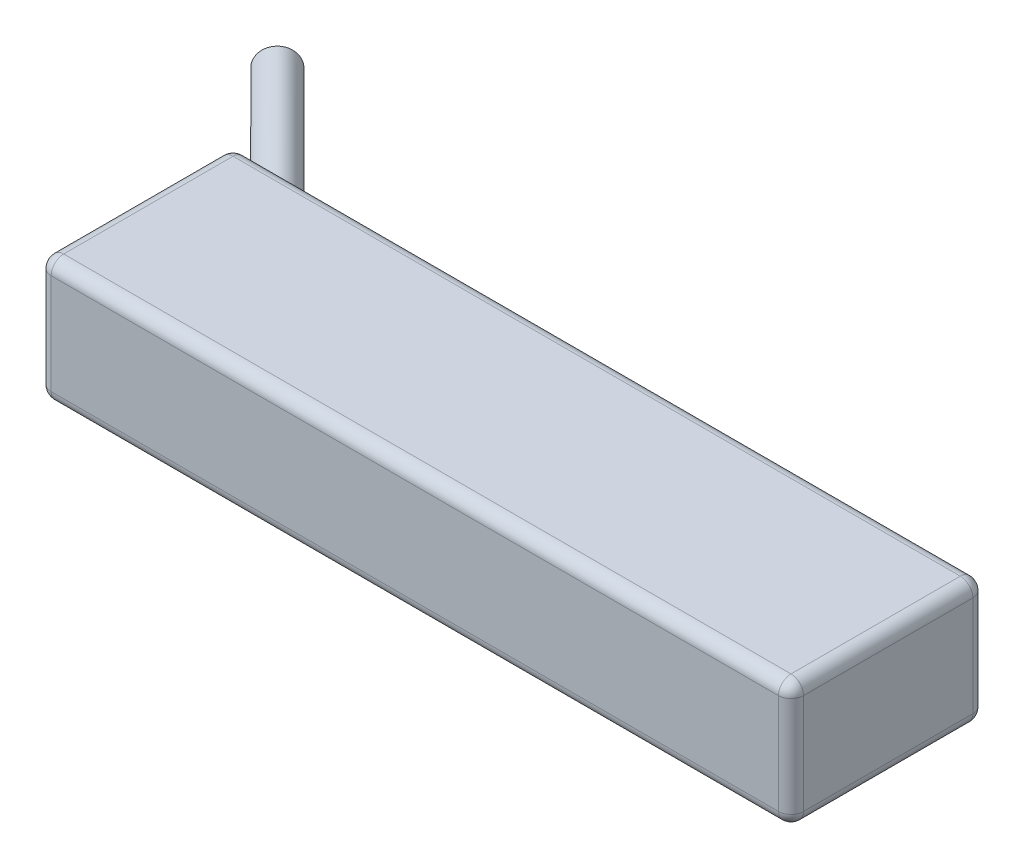
ISO-10303-21;
HEADER;
FILE_DESCRIPTION(('STEP AP214'),'2;1');
FILE_NAME('part.step','',(''),(''),'','','');
FILE_SCHEMA(('AUTOMOTIVE_DESIGN { 1 0 10303 214 1 1 1 1 }'));
ENDSEC;
DATA;
#1=APPLICATION_CONTEXT('core data for automotive mechanical design processes');
#2=APPLICATION_PROTOCOL_DEFINITION('international standard','automotive_design',2000,#1);
#3=PRODUCT_CONTEXT('',#1,'mechanical');
#4=PRODUCT('Part','Part','',(#3));
#5=PRODUCT_RELATED_PRODUCT_CATEGORY('part','',(#4));
#6=PRODUCT_DEFINITION_FORMATION('','',#4);
#7=PRODUCT_DEFINITION_CONTEXT('part definition',#1,'design');
#8=PRODUCT_DEFINITION('design','',#6,#7);
#9=PRODUCT_DEFINITION_SHAPE('','',#8);
#10=(LENGTH_UNIT() NAMED_UNIT(*) SI_UNIT(.MILLI.,.METRE.));
#11=(NAMED_UNIT(*) PLANE_ANGLE_UNIT() SI_UNIT($,.RADIAN.));
#12=(NAMED_UNIT(*) SI_UNIT($,.STERADIAN.) SOLID_ANGLE_UNIT());
#13=UNCERTAINTY_MEASURE_WITH_UNIT(LENGTH_MEASURE(1.E-05),#10,'distance_accuracy_value','');
#14=(GEOMETRIC_REPRESENTATION_CONTEXT(3) GLOBAL_UNCERTAINTY_ASSIGNED_CONTEXT((#13)) GLOBAL_UNIT_ASSIGNED_CONTEXT((#10,
#11,#12)) REPRESENTATION_CONTEXT('',''));
#15=CARTESIAN_POINT('',(0.,0.,0.));
#16=DIRECTION('',(0.,0.,1.));
#17=DIRECTION('',(1.,0.,0.));
#18=AXIS2_PLACEMENT_3D('',#15,#16,#17);
#19=CARTESIAN_POINT('',(60.,10.,-15.5));
#20=DIRECTION('',(-1.,0.,0.));
#21=DIRECTION('',(0.,0.,1.));
#22=AXIS2_PLACEMENT_3D('',#19,#20,#21);
#23=PLANE('',#22);
#24=DIRECTION('',(0.,-1.,0.));
#25=VECTOR('',#24,1.);
#26=CARTESIAN_POINT('',(60.,10.,13.5));
#27=LINE('',#26,#25);
#28=CARTESIAN_POINT('',(60.,8.,13.5));
#29=VERTEX_POINT('',#28);
#30=CARTESIAN_POINT('',(60.,-8.,13.5));
#31=VERTEX_POINT('',#30);
#32=EDGE_CURVE('E165',#29,#31,#27,.T.);
#33=ORIENTED_EDGE('',*,*,#32,.T.);
#34=DIRECTION('',(0.,0.,-1.));
#35=VECTOR('',#34,1.);
#36=CARTESIAN_POINT('',(60.,-8.,-15.5));
#37=LINE('',#36,#35);
#38=CARTESIAN_POINT('',(60.,-8.,-13.5));
#39=VERTEX_POINT('',#38);
#40=EDGE_CURVE('E170',#31,#39,#37,.T.);
#41=ORIENTED_EDGE('',*,*,#40,.T.);
#42=DIRECTION('',(0.,-1.,0.));
#43=VECTOR('',#42,1.);
#44=CARTESIAN_POINT('',(60.,10.,-13.5));
#45=LINE('',#44,#43);
#46=CARTESIAN_POINT('',(60.,8.,-13.5));
#47=VERTEX_POINT('',#46);
#48=EDGE_CURVE('E167',#39,#47,#45,.F.);
#49=ORIENTED_EDGE('',*,*,#48,.T.);
#50=DIRECTION('',(0.,0.,-1.));
#51=VECTOR('',#50,1.);
#52=CARTESIAN_POINT('',(60.,8.,15.5));
#53=LINE('',#52,#51);
#54=EDGE_CURVE('E163',#47,#29,#53,.F.);
#55=ORIENTED_EDGE('',*,*,#54,.T.);
#56=EDGE_LOOP('',(#33,#41,#49,#55));
#57=FACE_BOUND('',#56,.T.);
#58=ADVANCED_FACE('F36',(#57),#23,.F.);
#59=CARTESIAN_POINT('',(-60.,10.,-15.5));
#60=DIRECTION('',(0.,0.,1.));
#61=DIRECTION('',(1.,0.,0.));
#62=AXIS2_PLACEMENT_3D('',#59,#60,#61);
#63=PLANE('',#62);
#64=DIRECTION('',(0.,-1.,0.));
#65=VECTOR('',#64,1.);
#66=CARTESIAN_POINT('',(58.,10.,-15.5));
#67=LINE('',#66,#65);
#68=CARTESIAN_POINT('',(58.,8.,-15.5));
#69=VERTEX_POINT('',#68);
#70=CARTESIAN_POINT('',(58.,-8.,-15.5));
#71=VERTEX_POINT('',#70);
#72=EDGE_CURVE('E158',#69,#71,#67,.T.);
#73=ORIENTED_EDGE('',*,*,#72,.T.);
#74=DIRECTION('',(-1.,0.,0.));
#75=VECTOR('',#74,1.);
#76=CARTESIAN_POINT('',(-60.,-8.,-15.5));
#77=LINE('',#76,#75);
#78=CARTESIAN_POINT('',(-58.,-8.,-15.5));
#79=VERTEX_POINT('',#78);
#80=EDGE_CURVE('E161',#71,#79,#77,.T.);
#81=ORIENTED_EDGE('',*,*,#80,.T.);
#82=DIRECTION('',(0.,-1.,0.));
#83=VECTOR('',#82,1.);
#84=CARTESIAN_POINT('',(-58.,10.,-15.5));
#85=LINE('',#84,#83);
#86=CARTESIAN_POINT('',(-58.,8.,-15.5));
#87=VERTEX_POINT('',#86);
#88=EDGE_CURVE('E153',#79,#87,#85,.F.);
#89=ORIENTED_EDGE('',*,*,#88,.T.);
#90=DIRECTION('',(-1.,0.,0.));
#91=VECTOR('',#90,1.);
#92=CARTESIAN_POINT('',(60.,8.,-15.5));
#93=LINE('',#92,#91);
#94=EDGE_CURVE('E151',#87,#69,#93,.F.);
#95=ORIENTED_EDGE('',*,*,#94,.T.);
#96=EDGE_LOOP('',(#73,#81,#89,#95));
#97=FACE_BOUND('',#96,.T.);
#98=DIRECTION('',(0.,1.,0.));
#99=VECTOR('',#98,1.);
#100=CARTESIAN_POINT('',(-49.9999999999998,10.,-15.5));
#101=LINE('',#100,#99);
#102=CARTESIAN_POINT('',(-49.9999999999998,-6.17040966608935,-15.5));
#103=VERTEX_POINT('',#102);
#104=CARTESIAN_POINT('',(-49.9999999999998,-1.82959033391066,-15.5));
#105=VERTEX_POINT('',#104);
#106=EDGE_CURVE('E135',#103,#105,#101,.T.);
#107=ORIENTED_EDGE('',*,*,#106,.T.);
#108=CARTESIAN_POINT('',(-52.9289321881345,-4.,-15.5));
#109=DIRECTION('',(0.,0.,1.));
#110=DIRECTION('',(1.,0.,0.));
#111=AXIS2_PLACEMENT_3D('',#108,#109,#110);
#112=ELLIPSE('',#111,4.24264068711926,3.);
#113=EDGE_CURVE('E142',#105,#103,#112,.T.);
#114=ORIENTED_EDGE('',*,*,#113,.T.);
#115=EDGE_LOOP('',(#107,#114));
#116=FACE_BOUND('',#115,.T.);
#117=DIRECTION('',(0.,1.,0.));
#118=VECTOR('',#117,1.);
#119=CARTESIAN_POINT('',(-49.9999999999998,10.,-15.5));
#120=LINE('',#119,#118);
#121=CARTESIAN_POINT('',(-49.9999999999998,1.82959033391064,-15.5));
#122=VERTEX_POINT('',#121);
#123=CARTESIAN_POINT('',(-49.9999999999998,6.17040966608935,-15.5));
#124=VERTEX_POINT('',#123);
#125=EDGE_CURVE('E627',#122,#124,#120,.T.);
#126=ORIENTED_EDGE('',*,*,#125,.T.);
#127=CARTESIAN_POINT('',(-52.9289321881345,4.,-15.5));
#128=DIRECTION('',(0.,0.,1.));
#129=DIRECTION('',(1.,0.,0.));
#130=AXIS2_PLACEMENT_3D('',#127,#128,#129);
#131=ELLIPSE('',#130,4.24264068711927,3.);
#132=EDGE_CURVE('E143',#124,#122,#131,.T.);
#133=ORIENTED_EDGE('',*,*,#132,.T.);
#134=EDGE_LOOP('',(#126,#133));
#135=FACE_BOUND('',#134,.T.);
#136=ADVANCED_FACE('F149',(#97,#116,#135),#63,.F.);
#137=CARTESIAN_POINT('',(-60.,10.,-15.5));
#138=DIRECTION('',(1.,0.,0.));
#139=DIRECTION('',(0.,0.,-1.));
#140=AXIS2_PLACEMENT_3D('',#137,#138,#139);
#141=PLANE('',#140);
#142=DIRECTION('',(0.,-1.,0.));
#143=VECTOR('',#142,1.);
#144=CARTESIAN_POINT('',(-60.,10.,-13.5));
#145=LINE('',#144,#143);
#146=CARTESIAN_POINT('',(-60.,8.,-13.5));
#147=VERTEX_POINT('',#146);
#148=CARTESIAN_POINT('',(-60.,-8.,-13.5));
#149=VERTEX_POINT('',#148);
#150=EDGE_CURVE('E176',#147,#149,#145,.T.);
#151=ORIENTED_EDGE('',*,*,#150,.T.);
#152=DIRECTION('',(0.,0.,1.));
#153=VECTOR('',#152,1.);
#154=CARTESIAN_POINT('',(-60.,-8.,-15.5));
#155=LINE('',#154,#153);
#156=CARTESIAN_POINT('',(-60.,-8.,13.5));
#157=VERTEX_POINT('',#156);
#158=EDGE_CURVE('E179',#149,#157,#155,.T.);
#159=ORIENTED_EDGE('',*,*,#158,.T.);
#160=DIRECTION('',(0.,-1.,0.));
#161=VECTOR('',#160,1.);
#162=CARTESIAN_POINT('',(-60.,10.,13.5));
#163=LINE('',#162,#161);
#164=CARTESIAN_POINT('',(-60.,8.,13.5));
#165=VERTEX_POINT('',#164);
#166=EDGE_CURVE('E174',#157,#165,#163,.F.);
#167=ORIENTED_EDGE('',*,*,#166,.T.);
#168=DIRECTION('',(0.,0.,1.));
#169=VECTOR('',#168,1.);
#170=CARTESIAN_POINT('',(-60.,8.,-15.5));
#171=LINE('',#170,#169);
#172=EDGE_CURVE('E172',#165,#147,#171,.F.);
#173=ORIENTED_EDGE('',*,*,#172,.T.);
#174=EDGE_LOOP('',(#151,#159,#167,#173));
#175=FACE_BOUND('',#174,.T.);
#176=ADVANCED_FACE('F318',(#175),#141,.F.);
#177=CARTESIAN_POINT('',(-60.,10.,15.5));
#178=DIRECTION('',(0.,0.,-1.));
#179=DIRECTION('',(-1.,0.,0.));
#180=AXIS2_PLACEMENT_3D('',#177,#178,#179);
#181=PLANE('',#180);
#182=DIRECTION('',(0.,-1.,0.));
#183=VECTOR('',#182,1.);
#184=CARTESIAN_POINT('',(-58.,10.,15.5));
#185=LINE('',#184,#183);
#186=CARTESIAN_POINT('',(-58.,8.,15.5));
#187=VERTEX_POINT('',#186);
#188=CARTESIAN_POINT('',(-58.,-8.,15.5));
#189=VERTEX_POINT('',#188);
#190=EDGE_CURVE('E185',#187,#189,#185,.T.);
#191=ORIENTED_EDGE('',*,*,#190,.T.);
#192=DIRECTION('',(1.,0.,0.));
#193=VECTOR('',#192,1.);
#194=CARTESIAN_POINT('',(-60.,-8.,15.5));
#195=LINE('',#194,#193);
#196=CARTESIAN_POINT('',(58.,-8.,15.5));
#197=VERTEX_POINT('',#196);
#198=EDGE_CURVE('E188',#189,#197,#195,.T.);
#199=ORIENTED_EDGE('',*,*,#198,.T.);
#200=DIRECTION('',(0.,-1.,0.));
#201=VECTOR('',#200,1.);
#202=CARTESIAN_POINT('',(58.,10.,15.5));
#203=LINE('',#202,#201);
#204=CARTESIAN_POINT('',(58.,8.,15.5));
#205=VERTEX_POINT('',#204);
#206=EDGE_CURVE('E183',#197,#205,#203,.F.);
#207=ORIENTED_EDGE('',*,*,#206,.T.);
#208=DIRECTION('',(1.,0.,0.));
#209=VECTOR('',#208,1.);
#210=CARTESIAN_POINT('',(-60.,8.,15.5));
#211=LINE('',#210,#209);
#212=EDGE_CURVE('E181',#205,#187,#211,.F.);
#213=ORIENTED_EDGE('',*,*,#212,.T.);
#214=EDGE_LOOP('',(#191,#199,#207,#213));
#215=FACE_BOUND('',#214,.T.);
#216=ADVANCED_FACE('F321',(#215),#181,.F.);
#217=CARTESIAN_POINT('',(0.,10.,0.));
#218=DIRECTION('',(0.,1.,0.));
#219=DIRECTION('',(0.,0.,1.));
#220=AXIS2_PLACEMENT_3D('',#217,#218,#219);
#221=PLANE('',#220);
#222=DIRECTION('',(0.,0.,1.));
#223=VECTOR('',#222,1.);
#224=CARTESIAN_POINT('',(-58.,10.,15.5));
#225=LINE('',#224,#223);
#226=CARTESIAN_POINT('',(-58.,10.,-13.5));
#227=VERTEX_POINT('',#226);
#228=CARTESIAN_POINT('',(-58.,10.,13.5));
#229=VERTEX_POINT('',#228);
#230=EDGE_CURVE('E45',#227,#229,#225,.T.);
#231=ORIENTED_EDGE('',*,*,#230,.T.);
#232=DIRECTION('',(1.,0.,0.));
#233=VECTOR('',#232,1.);
#234=CARTESIAN_POINT('',(60.,10.,13.5));
#235=LINE('',#234,#233);
#236=CARTESIAN_POINT('',(58.,10.,13.5));
#237=VERTEX_POINT('',#236);
#238=EDGE_CURVE('E11',#229,#237,#235,.T.);
#239=ORIENTED_EDGE('',*,*,#238,.T.);
#240=DIRECTION('',(0.,0.,-1.));
#241=VECTOR('',#240,1.);
#242=CARTESIAN_POINT('',(58.,10.,-15.5));
#243=LINE('',#242,#241);
#244=CARTESIAN_POINT('',(58.,10.,-13.5));
#245=VERTEX_POINT('',#244);
#246=EDGE_CURVE('E199',#237,#245,#243,.T.);
#247=ORIENTED_EDGE('',*,*,#246,.T.);
#248=DIRECTION('',(-1.,0.,0.));
#249=VECTOR('',#248,1.);
#250=CARTESIAN_POINT('',(-60.,10.,-13.5));
#251=LINE('',#250,#249);
#252=EDGE_CURVE('E56',#245,#227,#251,.T.);
#253=ORIENTED_EDGE('',*,*,#252,.T.);
#254=EDGE_LOOP('',(#231,#239,#247,#253));
#255=FACE_BOUND('',#254,.T.);
#256=ADVANCED_FACE('F285',(#255),#221,.T.);
#257=CARTESIAN_POINT('',(0.,-10.,0.));
#258=DIRECTION('',(0.,1.,0.));
#259=DIRECTION('',(0.,0.,1.));
#260=AXIS2_PLACEMENT_3D('',#257,#258,#259);
#261=PLANE('',#260);
#262=DIRECTION('',(0.,0.,1.));
#263=VECTOR('',#262,1.);
#264=CARTESIAN_POINT('',(-58.,-10.,0.));
#265=LINE('',#264,#263);
#266=CARTESIAN_POINT('',(-58.,-10.,13.5));
#267=VERTEX_POINT('',#266);
#268=CARTESIAN_POINT('',(-58.,-10.,-13.5));
#269=VERTEX_POINT('',#268);
#270=EDGE_CURVE('E194',#267,#269,#265,.F.);
#271=ORIENTED_EDGE('',*,*,#270,.T.);
#272=DIRECTION('',(-1.,0.,0.));
#273=VECTOR('',#272,1.);
#274=CARTESIAN_POINT('',(0.,-10.,-13.5));
#275=LINE('',#274,#273);
#276=CARTESIAN_POINT('',(58.,-10.,-13.5));
#277=VERTEX_POINT('',#276);
#278=EDGE_CURVE('E196',#269,#277,#275,.F.);
#279=ORIENTED_EDGE('',*,*,#278,.T.);
#280=DIRECTION('',(0.,0.,-1.));
#281=VECTOR('',#280,1.);
#282=CARTESIAN_POINT('',(58.,-10.,0.));
#283=LINE('',#282,#281);
#284=CARTESIAN_POINT('',(58.,-10.,13.5));
#285=VERTEX_POINT('',#284);
#286=EDGE_CURVE('E190',#277,#285,#283,.F.);
#287=ORIENTED_EDGE('',*,*,#286,.T.);
#288=DIRECTION('',(1.,0.,0.));
#289=VECTOR('',#288,1.);
#290=CARTESIAN_POINT('',(0.,-10.,13.5));
#291=LINE('',#290,#289);
#292=EDGE_CURVE('E192',#285,#267,#291,.F.);
#293=ORIENTED_EDGE('',*,*,#292,.T.);
#294=EDGE_LOOP('',(#271,#279,#287,#293));
#295=FACE_BOUND('',#294,.T.);
#296=ADVANCED_FACE('F565',(#295),#261,.F.);
#297=CARTESIAN_POINT('',(-72.6776695296635,4.,-35.2487373415292));
#298=DIRECTION('',(0.707106781186544,0.,0.707106781186551));
#299=DIRECTION('',(0.707106781186551,0.,-0.707106781186544));
#300=AXIS2_PLACEMENT_3D('',#297,#298,#299);
#301=CYLINDRICAL_SURFACE('',#300,3.);
#302=CARTESIAN_POINT('',(-72.6776695296635,4.,-35.2487373415292));
#303=DIRECTION('',(0.707106781186544,0.,0.707106781186551));
#304=DIRECTION('',(0.707106781186551,0.,-0.707106781186544));
#305=AXIS2_PLACEMENT_3D('',#302,#303,#304);
#306=CIRCLE('',#305,3.);
#307=CARTESIAN_POINT('',(-70.5563491861039,4.,-37.3700576850888));
#308=VERTEX_POINT('',#307);
#309=EDGE_CURVE('E621',#308,#308,#306,.T.);
#310=ORIENTED_EDGE('',*,*,#309,.T.);
#311=EDGE_LOOP('',(#310));
#312=FACE_BOUND('',#311,.T.);
#313=ORIENTED_EDGE('',*,*,#132,.F.);
#314=CARTESIAN_POINT('',(-51.4644660940672,4.,-14.0355339059326));
#315=DIRECTION('',(0.707106781186544,0.,0.707106781186551));
#316=DIRECTION('',(0.707106781186551,0.,-0.707106781186544));
#317=AXIS2_PLACEMENT_3D('',#314,#315,#316);
#318=CIRCLE('',#317,3.);
#319=EDGE_CURVE('E626',#122,#124,#318,.T.);
#320=ORIENTED_EDGE('',*,*,#319,.F.);
#321=EDGE_LOOP('',(#313,#320));
#322=FACE_BOUND('',#321,.T.);
#323=ADVANCED_FACE('F556',(#312,#322),#301,.T.);
#324=CARTESIAN_POINT('',(-51.4644660940672,4.,-14.0355339059326));
#325=DIRECTION('',(0.707106781186544,0.,0.707106781186551));
#326=DIRECTION('',(0.707106781186551,0.,-0.707106781186544));
#327=AXIS2_PLACEMENT_3D('',#324,#325,#326);
#328=PLANE('',#327);
#329=ORIENTED_EDGE('',*,*,#125,.F.);
#330=ORIENTED_EDGE('',*,*,#319,.T.);
#331=EDGE_LOOP('',(#329,#330));
#332=FACE_BOUND('',#331,.T.);
#333=ADVANCED_FACE('F547',(#332),#328,.T.);
#334=CARTESIAN_POINT('',(-72.6776695296635,4.,-35.2487373415292));
#335=DIRECTION('',(0.707106781186544,0.,0.707106781186551));
#336=DIRECTION('',(0.707106781186551,0.,-0.707106781186544));
#337=AXIS2_PLACEMENT_3D('',#334,#335,#336);
#338=PLANE('',#337);
#339=ORIENTED_EDGE('',*,*,#309,.F.);
#340=EDGE_LOOP('',(#339));
#341=FACE_BOUND('',#340,.T.);
#342=ADVANCED_FACE('F538',(#341),#338,.F.);
#343=CARTESIAN_POINT('',(-72.6776695296635,-4.,-35.2487373415292));
#344=DIRECTION('',(0.707106781186544,0.,0.707106781186551));
#345=DIRECTION('',(0.707106781186551,0.,-0.707106781186544));
#346=AXIS2_PLACEMENT_3D('',#343,#344,#345);
#347=CYLINDRICAL_SURFACE('',#346,3.);
#348=CARTESIAN_POINT('',(-72.6776695296635,-4.,-35.2487373415292));
#349=DIRECTION('',(0.707106781186544,0.,0.707106781186551));
#350=DIRECTION('',(0.707106781186551,0.,-0.707106781186544));
#351=AXIS2_PLACEMENT_3D('',#348,#349,#350);
#352=CIRCLE('',#351,3.);
#353=CARTESIAN_POINT('',(-70.5563491861039,-4.,-37.3700576850888));
#354=VERTEX_POINT('',#353);
#355=EDGE_CURVE('E147',#354,#354,#352,.T.);
#356=ORIENTED_EDGE('',*,*,#355,.T.);
#357=EDGE_LOOP('',(#356));
#358=FACE_BOUND('',#357,.T.);
#359=ORIENTED_EDGE('',*,*,#113,.F.);
#360=CARTESIAN_POINT('',(-51.4644660940672,-4.,-14.0355339059326));
#361=DIRECTION('',(0.707106781186544,0.,0.707106781186551));
#362=DIRECTION('',(0.707106781186551,0.,-0.707106781186544));
#363=AXIS2_PLACEMENT_3D('',#360,#361,#362);
#364=CIRCLE('',#363,3.);
#365=EDGE_CURVE('E138',#103,#105,#364,.T.);
#366=ORIENTED_EDGE('',*,*,#365,.F.);
#367=EDGE_LOOP('',(#359,#366));
#368=FACE_BOUND('',#367,.T.);
#369=ADVANCED_FACE('F146',(#358,#368),#347,.T.);
#370=CARTESIAN_POINT('',(-51.4644660940672,-4.,-14.0355339059326));
#371=DIRECTION('',(0.707106781186544,0.,0.707106781186551));
#372=DIRECTION('',(0.707106781186551,0.,-0.707106781186544));
#373=AXIS2_PLACEMENT_3D('',#370,#371,#372);
#374=PLANE('',#373);
#375=ORIENTED_EDGE('',*,*,#106,.F.);
#376=ORIENTED_EDGE('',*,*,#365,.T.);
#377=EDGE_LOOP('',(#375,#376));
#378=FACE_BOUND('',#377,.T.);
#379=ADVANCED_FACE('F137',(#378),#374,.T.);
#380=CARTESIAN_POINT('',(-72.6776695296635,-4.,-35.2487373415292));
#381=DIRECTION('',(0.707106781186544,0.,0.707106781186551));
#382=DIRECTION('',(0.707106781186551,0.,-0.707106781186544));
#383=AXIS2_PLACEMENT_3D('',#380,#381,#382);
#384=PLANE('',#383);
#385=ORIENTED_EDGE('',*,*,#355,.F.);
#386=EDGE_LOOP('',(#385));
#387=FACE_BOUND('',#386,.T.);
#388=ADVANCED_FACE('F515',(#387),#384,.F.);
#389=CARTESIAN_POINT('',(-58.,10.,13.5));
#390=DIRECTION('',(0.,-1.,0.));
#391=DIRECTION('',(0.,0.,-1.));
#392=AXIS2_PLACEMENT_3D('',#389,#390,#391);
#393=CYLINDRICAL_SURFACE('',#392,2.);
#394=CARTESIAN_POINT('',(-58.,8.,13.5));
#395=DIRECTION('',(0.,1.,0.));
#396=DIRECTION('',(0.,0.,1.));
#397=AXIS2_PLACEMENT_3D('',#394,#395,#396);
#398=CIRCLE('',#397,2.);
#399=EDGE_CURVE('E40',#165,#187,#398,.T.);
#400=ORIENTED_EDGE('',*,*,#399,.F.);
#401=ORIENTED_EDGE('',*,*,#166,.F.);
#402=CARTESIAN_POINT('',(-58.,-8.,13.5));
#403=DIRECTION('',(0.,-1.,0.));
#404=DIRECTION('',(0.,0.,-1.));
#405=AXIS2_PLACEMENT_3D('',#402,#403,#404);
#406=CIRCLE('',#405,2.);
#407=EDGE_CURVE('E263',#189,#157,#406,.T.);
#408=ORIENTED_EDGE('',*,*,#407,.F.);
#409=ORIENTED_EDGE('',*,*,#190,.F.);
#410=EDGE_LOOP('',(#400,#401,#408,#409));
#411=FACE_BOUND('',#410,.T.);
#412=ADVANCED_FACE('F38',(#411),#393,.T.);
#413=CARTESIAN_POINT('',(-58.,8.,13.5));
#414=DIRECTION('',(0.,0.,1.));
#415=DIRECTION('',(1.,0.,0.));
#416=AXIS2_PLACEMENT_3D('',#413,#414,#415);
#417=SPHERICAL_SURFACE('',#416,2.);
#418=CARTESIAN_POINT('',(-58.,8.,13.5));
#419=DIRECTION('',(0.,0.,1.));
#420=DIRECTION('',(1.,0.,0.));
#421=AXIS2_PLACEMENT_3D('',#418,#419,#420);
#422=CIRCLE('',#421,2.);
#423=EDGE_CURVE('E259',#165,#229,#422,.F.);
#424=ORIENTED_EDGE('',*,*,#423,.F.);
#425=ORIENTED_EDGE('',*,*,#399,.T.);
#426=CARTESIAN_POINT('',(-58.,8.,13.5));
#427=DIRECTION('',(-1.,0.,0.));
#428=DIRECTION('',(0.,0.,1.));
#429=AXIS2_PLACEMENT_3D('',#426,#427,#428);
#430=CIRCLE('',#429,2.);
#431=EDGE_CURVE('E261',#229,#187,#430,.F.);
#432=ORIENTED_EDGE('',*,*,#431,.F.);
#433=EDGE_LOOP('',(#424,#425,#432));
#434=FACE_BOUND('',#433,.T.);
#435=ADVANCED_FACE('F274',(#434),#417,.T.);
#436=CARTESIAN_POINT('',(-58.,-8.,13.5));
#437=DIRECTION('',(-1.,0.,0.));
#438=DIRECTION('',(0.,0.,1.));
#439=AXIS2_PLACEMENT_3D('',#436,#437,#438);
#440=SPHERICAL_SURFACE('',#439,2.);
#441=CARTESIAN_POINT('',(-58.,-8.,13.5));
#442=DIRECTION('',(-1.,0.,0.));
#443=DIRECTION('',(0.,0.,1.));
#444=AXIS2_PLACEMENT_3D('',#441,#442,#443);
#445=CIRCLE('',#444,2.);
#446=EDGE_CURVE('E253',#189,#267,#445,.F.);
#447=ORIENTED_EDGE('',*,*,#446,.F.);
#448=ORIENTED_EDGE('',*,*,#407,.T.);
#449=CARTESIAN_POINT('',(-58.,-8.,13.5));
#450=DIRECTION('',(0.,0.,1.));
#451=DIRECTION('',(1.,0.,0.));
#452=AXIS2_PLACEMENT_3D('',#449,#450,#451);
#453=CIRCLE('',#452,2.);
#454=EDGE_CURVE('E256',#267,#157,#453,.F.);
#455=ORIENTED_EDGE('',*,*,#454,.F.);
#456=EDGE_LOOP('',(#447,#448,#455));
#457=FACE_BOUND('',#456,.T.);
#458=ADVANCED_FACE('F389',(#457),#440,.T.);
#459=CARTESIAN_POINT('',(0.,8.,13.5));
#460=DIRECTION('',(-1.,0.,0.));
#461=DIRECTION('',(0.,0.,1.));
#462=AXIS2_PLACEMENT_3D('',#459,#460,#461);
#463=CYLINDRICAL_SURFACE('',#462,2.);
#464=ORIENTED_EDGE('',*,*,#431,.T.);
#465=ORIENTED_EDGE('',*,*,#212,.F.);
#466=CARTESIAN_POINT('',(58.,8.,13.5));
#467=DIRECTION('',(1.,0.,0.));
#468=DIRECTION('',(0.,0.,-1.));
#469=AXIS2_PLACEMENT_3D('',#466,#467,#468);
#470=CIRCLE('',#469,2.);
#471=EDGE_CURVE('E247',#237,#205,#470,.T.);
#472=ORIENTED_EDGE('',*,*,#471,.F.);
#473=ORIENTED_EDGE('',*,*,#238,.F.);
#474=EDGE_LOOP('',(#464,#465,#472,#473));
#475=FACE_BOUND('',#474,.T.);
#476=ADVANCED_FACE('F282',(#475),#463,.T.);
#477=CARTESIAN_POINT('',(-58.,8.,0.));
#478=DIRECTION('',(0.,0.,-1.));
#479=DIRECTION('',(-1.,0.,0.));
#480=AXIS2_PLACEMENT_3D('',#477,#478,#479);
#481=CYLINDRICAL_SURFACE('',#480,2.);
#482=ORIENTED_EDGE('',*,*,#423,.T.);
#483=ORIENTED_EDGE('',*,*,#230,.F.);
#484=CARTESIAN_POINT('',(-58.,8.,-13.5));
#485=DIRECTION('',(0.,0.,-1.));
#486=DIRECTION('',(-1.,0.,0.));
#487=AXIS2_PLACEMENT_3D('',#484,#485,#486);
#488=CIRCLE('',#487,2.);
#489=EDGE_CURVE('E244',#147,#227,#488,.T.);
#490=ORIENTED_EDGE('',*,*,#489,.F.);
#491=ORIENTED_EDGE('',*,*,#172,.F.);
#492=EDGE_LOOP('',(#482,#483,#490,#491));
#493=FACE_BOUND('',#492,.T.);
#494=ADVANCED_FACE('F316',(#493),#481,.T.);
#495=CARTESIAN_POINT('',(-58.,10.,-13.5));
#496=DIRECTION('',(0.,-1.,0.));
#497=DIRECTION('',(0.,0.,-1.));
#498=AXIS2_PLACEMENT_3D('',#495,#496,#497);
#499=CYLINDRICAL_SURFACE('',#498,2.);
#500=CARTESIAN_POINT('',(-58.,-8.,-13.5));
#501=DIRECTION('',(0.,-1.,0.));
#502=DIRECTION('',(0.,0.,-1.));
#503=AXIS2_PLACEMENT_3D('',#500,#501,#502);
#504=CIRCLE('',#503,2.);
#505=EDGE_CURVE('E238',#149,#79,#504,.T.);
#506=ORIENTED_EDGE('',*,*,#505,.F.);
#507=ORIENTED_EDGE('',*,*,#150,.F.);
#508=CARTESIAN_POINT('',(-58.,8.,-13.5));
#509=DIRECTION('',(0.,1.,0.));
#510=DIRECTION('',(0.,0.,1.));
#511=AXIS2_PLACEMENT_3D('',#508,#509,#510);
#512=CIRCLE('',#511,2.);
#513=EDGE_CURVE('E241',#87,#147,#512,.T.);
#514=ORIENTED_EDGE('',*,*,#513,.F.);
#515=ORIENTED_EDGE('',*,*,#88,.F.);
#516=EDGE_LOOP('',(#506,#507,#514,#515));
#517=FACE_BOUND('',#516,.T.);
#518=ADVANCED_FACE('F311',(#517),#499,.T.);
#519=CARTESIAN_POINT('',(-58.,-8.,-15.5));
#520=DIRECTION('',(0.,0.,1.));
#521=DIRECTION('',(1.,0.,0.));
#522=AXIS2_PLACEMENT_3D('',#519,#520,#521);
#523=CYLINDRICAL_SURFACE('',#522,2.);
#524=ORIENTED_EDGE('',*,*,#454,.T.);
#525=ORIENTED_EDGE('',*,*,#158,.F.);
#526=CARTESIAN_POINT('',(-58.,-8.,-13.5));
#527=DIRECTION('',(0.,0.,-1.));
#528=DIRECTION('',(-1.,0.,0.));
#529=AXIS2_PLACEMENT_3D('',#526,#527,#528);
#530=CIRCLE('',#529,2.);
#531=EDGE_CURVE('E236',#269,#149,#530,.T.);
#532=ORIENTED_EDGE('',*,*,#531,.F.);
#533=ORIENTED_EDGE('',*,*,#270,.F.);
#534=EDGE_LOOP('',(#524,#525,#532,#533));
#535=FACE_BOUND('',#534,.T.);
#536=ADVANCED_FACE('F388',(#535),#523,.T.);
#537=CARTESIAN_POINT('',(-60.,-8.,13.5));
#538=DIRECTION('',(1.,0.,0.));
#539=DIRECTION('',(0.,0.,-1.));
#540=AXIS2_PLACEMENT_3D('',#537,#538,#539);
#541=CYLINDRICAL_SURFACE('',#540,2.);
#542=ORIENTED_EDGE('',*,*,#446,.T.);
#543=ORIENTED_EDGE('',*,*,#292,.F.);
#544=CARTESIAN_POINT('',(58.,-8.,13.5));
#545=DIRECTION('',(1.,0.,0.));
#546=DIRECTION('',(0.,0.,-1.));
#547=AXIS2_PLACEMENT_3D('',#544,#545,#546);
#548=CIRCLE('',#547,2.);
#549=EDGE_CURVE('E233',#197,#285,#548,.T.);
#550=ORIENTED_EDGE('',*,*,#549,.F.);
#551=ORIENTED_EDGE('',*,*,#198,.F.);
#552=EDGE_LOOP('',(#542,#543,#550,#551));
#553=FACE_BOUND('',#552,.T.);
#554=ADVANCED_FACE('F331',(#553),#541,.T.);
#555=CARTESIAN_POINT('',(58.,10.,13.5));
#556=DIRECTION('',(0.,-1.,0.));
#557=DIRECTION('',(0.,0.,-1.));
#558=AXIS2_PLACEMENT_3D('',#555,#556,#557);
#559=CYLINDRICAL_SURFACE('',#558,2.);
#560=CARTESIAN_POINT('',(58.,8.,13.5));
#561=DIRECTION('',(0.,1.,0.));
#562=DIRECTION('',(0.,0.,1.));
#563=AXIS2_PLACEMENT_3D('',#560,#561,#562);
#564=CIRCLE('',#563,2.);
#565=EDGE_CURVE('E250',#205,#29,#564,.T.);
#566=ORIENTED_EDGE('',*,*,#565,.F.);
#567=ORIENTED_EDGE('',*,*,#206,.F.);
#568=CARTESIAN_POINT('',(58.,-8.,13.5));
#569=DIRECTION('',(0.,-1.,0.));
#570=DIRECTION('',(0.,0.,-1.));
#571=AXIS2_PLACEMENT_3D('',#568,#569,#570);
#572=CIRCLE('',#571,2.);
#573=EDGE_CURVE('E230',#31,#197,#572,.T.);
#574=ORIENTED_EDGE('',*,*,#573,.F.);
#575=ORIENTED_EDGE('',*,*,#32,.F.);
#576=EDGE_LOOP('',(#566,#567,#574,#575));
#577=FACE_BOUND('',#576,.T.);
#578=ADVANCED_FACE('F326',(#577),#559,.T.);
#579=CARTESIAN_POINT('',(58.,8.,13.5));
#580=DIRECTION('',(0.,0.,1.));
#581=DIRECTION('',(1.,0.,0.));
#582=AXIS2_PLACEMENT_3D('',#579,#580,#581);
#583=SPHERICAL_SURFACE('',#582,2.);
#584=ORIENTED_EDGE('',*,*,#471,.T.);
#585=ORIENTED_EDGE('',*,*,#565,.T.);
#586=CARTESIAN_POINT('',(58.,8.,13.5));
#587=DIRECTION('',(0.,0.,1.));
#588=DIRECTION('',(0.,-1.,0.));
#589=AXIS2_PLACEMENT_3D('',#586,#587,#588);
#590=CIRCLE('',#589,2.);
#591=EDGE_CURVE('E227',#237,#29,#590,.F.);
#592=ORIENTED_EDGE('',*,*,#591,.F.);
#593=EDGE_LOOP('',(#584,#585,#592));
#594=FACE_BOUND('',#593,.T.);
#595=ADVANCED_FACE('F341',(#594),#583,.T.);
#596=CARTESIAN_POINT('',(-58.,8.,-13.5));
#597=DIRECTION('',(-1.,0.,0.));
#598=DIRECTION('',(0.,0.,1.));
#599=AXIS2_PLACEMENT_3D('',#596,#597,#598);
#600=SPHERICAL_SURFACE('',#599,2.);
#601=ORIENTED_EDGE('',*,*,#513,.T.);
#602=ORIENTED_EDGE('',*,*,#489,.T.);
#603=CARTESIAN_POINT('',(-58.,8.,-13.5));
#604=DIRECTION('',(-1.,0.,0.));
#605=DIRECTION('',(0.,0.,1.));
#606=AXIS2_PLACEMENT_3D('',#603,#604,#605);
#607=CIRCLE('',#606,2.);
#608=EDGE_CURVE('E224',#87,#227,#607,.F.);
#609=ORIENTED_EDGE('',*,*,#608,.F.);
#610=EDGE_LOOP('',(#601,#602,#609));
#611=FACE_BOUND('',#610,.T.);
#612=ADVANCED_FACE('F314',(#611),#600,.T.);
#613=CARTESIAN_POINT('',(-58.,-8.,-13.5));
#614=DIRECTION('',(-1.,0.,0.));
#615=DIRECTION('',(0.,0.,1.));
#616=AXIS2_PLACEMENT_3D('',#613,#614,#615);
#617=SPHERICAL_SURFACE('',#616,2.);
#618=ORIENTED_EDGE('',*,*,#531,.T.);
#619=ORIENTED_EDGE('',*,*,#505,.T.);
#620=CARTESIAN_POINT('',(-58.,-8.,-13.5));
#621=DIRECTION('',(-1.,0.,0.));
#622=DIRECTION('',(0.,0.,1.));
#623=AXIS2_PLACEMENT_3D('',#620,#621,#622);
#624=CIRCLE('',#623,2.);
#625=EDGE_CURVE('E221',#269,#79,#624,.F.);
#626=ORIENTED_EDGE('',*,*,#625,.F.);
#627=EDGE_LOOP('',(#618,#619,#626));
#628=FACE_BOUND('',#627,.T.);
#629=ADVANCED_FACE('F348',(#628),#617,.T.);
#630=CARTESIAN_POINT('',(58.,-8.,13.5));
#631=DIRECTION('',(0.,0.,1.));
#632=DIRECTION('',(0.,-1.,0.));
#633=AXIS2_PLACEMENT_3D('',#630,#631,#632);
#634=SPHERICAL_SURFACE('',#633,2.);
#635=ORIENTED_EDGE('',*,*,#573,.T.);
#636=ORIENTED_EDGE('',*,*,#549,.T.);
#637=CARTESIAN_POINT('',(58.,-8.,13.5));
#638=DIRECTION('',(0.,0.,1.));
#639=DIRECTION('',(1.,0.,0.));
#640=AXIS2_PLACEMENT_3D('',#637,#638,#639);
#641=CIRCLE('',#640,2.);
#642=EDGE_CURVE('E218',#31,#285,#641,.F.);
#643=ORIENTED_EDGE('',*,*,#642,.F.);
#644=EDGE_LOOP('',(#635,#636,#643));
#645=FACE_BOUND('',#644,.T.);
#646=ADVANCED_FACE('F333',(#645),#634,.T.);
#647=CARTESIAN_POINT('',(58.,8.,0.));
#648=DIRECTION('',(0.,0.,1.));
#649=DIRECTION('',(1.,0.,0.));
#650=AXIS2_PLACEMENT_3D('',#647,#648,#649);
#651=CYLINDRICAL_SURFACE('',#650,2.);
#652=ORIENTED_EDGE('',*,*,#591,.T.);
#653=ORIENTED_EDGE('',*,*,#54,.F.);
#654=CARTESIAN_POINT('',(58.,8.,-13.5));
#655=DIRECTION('',(0.,0.,-1.));
#656=DIRECTION('',(-1.,0.,0.));
#657=AXIS2_PLACEMENT_3D('',#654,#655,#656);
#658=CIRCLE('',#657,2.);
#659=EDGE_CURVE('E215',#245,#47,#658,.T.);
#660=ORIENTED_EDGE('',*,*,#659,.F.);
#661=ORIENTED_EDGE('',*,*,#246,.F.);
#662=EDGE_LOOP('',(#652,#653,#660,#661));
#663=FACE_BOUND('',#662,.T.);
#664=ADVANCED_FACE('F296',(#663),#651,.T.);
#665=CARTESIAN_POINT('',(0.,8.,-13.5));
#666=DIRECTION('',(1.,0.,0.));
#667=DIRECTION('',(0.,0.,-1.));
#668=AXIS2_PLACEMENT_3D('',#665,#666,#667);
#669=CYLINDRICAL_SURFACE('',#668,2.);
#670=ORIENTED_EDGE('',*,*,#608,.T.);
#671=ORIENTED_EDGE('',*,*,#252,.F.);
#672=CARTESIAN_POINT('',(58.,8.,-13.5));
#673=DIRECTION('',(1.,0.,0.));
#674=DIRECTION('',(0.,1.,0.));
#675=AXIS2_PLACEMENT_3D('',#672,#673,#674);
#676=CIRCLE('',#675,2.);
#677=EDGE_CURVE('E212',#69,#245,#676,.T.);
#678=ORIENTED_EDGE('',*,*,#677,.F.);
#679=ORIENTED_EDGE('',*,*,#94,.F.);
#680=EDGE_LOOP('',(#670,#671,#678,#679));
#681=FACE_BOUND('',#680,.T.);
#682=ADVANCED_FACE('F291',(#681),#669,.T.);
#683=CARTESIAN_POINT('',(-60.,-8.,-13.5));
#684=DIRECTION('',(-1.,0.,0.));
#685=DIRECTION('',(0.,0.,1.));
#686=AXIS2_PLACEMENT_3D('',#683,#684,#685);
#687=CYLINDRICAL_SURFACE('',#686,2.);
#688=ORIENTED_EDGE('',*,*,#625,.T.);
#689=ORIENTED_EDGE('',*,*,#80,.F.);
#690=CARTESIAN_POINT('',(58.,-8.,-13.5));
#691=DIRECTION('',(1.,0.,0.));
#692=DIRECTION('',(0.,0.,-1.));
#693=AXIS2_PLACEMENT_3D('',#690,#691,#692);
#694=CIRCLE('',#693,2.);
#695=EDGE_CURVE('E209',#277,#71,#694,.T.);
#696=ORIENTED_EDGE('',*,*,#695,.F.);
#697=ORIENTED_EDGE('',*,*,#278,.F.);
#698=EDGE_LOOP('',(#688,#689,#696,#697));
#699=FACE_BOUND('',#698,.T.);
#700=ADVANCED_FACE('F369',(#699),#687,.T.);
#701=CARTESIAN_POINT('',(58.,-8.,-15.5));
#702=DIRECTION('',(0.,0.,-1.));
#703=DIRECTION('',(-1.,0.,0.));
#704=AXIS2_PLACEMENT_3D('',#701,#702,#703);
#705=CYLINDRICAL_SURFACE('',#704,2.);
#706=ORIENTED_EDGE('',*,*,#642,.T.);
#707=ORIENTED_EDGE('',*,*,#286,.F.);
#708=CARTESIAN_POINT('',(58.,-8.,-13.5));
#709=DIRECTION('',(0.,0.,-1.));
#710=DIRECTION('',(-1.,0.,0.));
#711=AXIS2_PLACEMENT_3D('',#708,#709,#710);
#712=CIRCLE('',#711,2.);
#713=EDGE_CURVE('E207',#39,#277,#712,.T.);
#714=ORIENTED_EDGE('',*,*,#713,.F.);
#715=ORIENTED_EDGE('',*,*,#40,.F.);
#716=EDGE_LOOP('',(#706,#707,#714,#715));
#717=FACE_BOUND('',#716,.T.);
#718=ADVANCED_FACE('F338',(#717),#705,.T.);
#719=CARTESIAN_POINT('',(58.,8.,-13.5));
#720=DIRECTION('',(0.,1.,0.));
#721=DIRECTION('',(-1.,0.,0.));
#722=AXIS2_PLACEMENT_3D('',#719,#720,#721);
#723=SPHERICAL_SURFACE('',#722,2.);
#724=ORIENTED_EDGE('',*,*,#677,.T.);
#725=ORIENTED_EDGE('',*,*,#659,.T.);
#726=CARTESIAN_POINT('',(58.,8.,-13.5));
#727=DIRECTION('',(0.,1.,0.));
#728=DIRECTION('',(0.,0.,1.));
#729=AXIS2_PLACEMENT_3D('',#726,#727,#728);
#730=CIRCLE('',#729,2.);
#731=EDGE_CURVE('E205',#69,#47,#730,.F.);
#732=ORIENTED_EDGE('',*,*,#731,.F.);
#733=EDGE_LOOP('',(#724,#725,#732));
#734=FACE_BOUND('',#733,.T.);
#735=ADVANCED_FACE('F298',(#734),#723,.T.);
#736=CARTESIAN_POINT('',(58.,-8.,-13.5));
#737=DIRECTION('',(0.,-1.,0.));
#738=DIRECTION('',(0.,0.,-1.));
#739=AXIS2_PLACEMENT_3D('',#736,#737,#738);
#740=SPHERICAL_SURFACE('',#739,2.);
#741=ORIENTED_EDGE('',*,*,#713,.T.);
#742=ORIENTED_EDGE('',*,*,#695,.T.);
#743=CARTESIAN_POINT('',(58.,-8.,-13.5));
#744=DIRECTION('',(0.,-1.,0.));
#745=DIRECTION('',(0.,0.,-1.));
#746=AXIS2_PLACEMENT_3D('',#743,#744,#745);
#747=CIRCLE('',#746,2.);
#748=EDGE_CURVE('E203',#39,#71,#747,.F.);
#749=ORIENTED_EDGE('',*,*,#748,.F.);
#750=EDGE_LOOP('',(#741,#742,#749));
#751=FACE_BOUND('',#750,.T.);
#752=ADVANCED_FACE('F361',(#751),#740,.T.);
#753=CARTESIAN_POINT('',(58.,10.,-13.5));
#754=DIRECTION('',(0.,-1.,0.));
#755=DIRECTION('',(0.,0.,-1.));
#756=AXIS2_PLACEMENT_3D('',#753,#754,#755);
#757=CYLINDRICAL_SURFACE('',#756,2.);
#758=ORIENTED_EDGE('',*,*,#731,.T.);
#759=ORIENTED_EDGE('',*,*,#48,.F.);
#760=ORIENTED_EDGE('',*,*,#748,.T.);
#761=ORIENTED_EDGE('',*,*,#72,.F.);
#762=EDGE_LOOP('',(#758,#759,#760,#761));
#763=FACE_BOUND('',#762,.T.);
#764=ADVANCED_FACE('F302',(#763),#757,.T.);
#765=CLOSED_SHELL('',(#58,#136,#176,#216,#256,#296,#323,#333,#342,#369,#379,#388,#412,#435,#458,
#476,#494,#518,#536,#554,#578,#595,#612,#629,#646,#664,#682,#700,#718,#735,#752,#764));
#766=MANIFOLD_SOLID_BREP('B2',#765);
#767=ADVANCED_BREP_SHAPE_REPRESENTATION('',(#18,#766),#14);
#768=SHAPE_DEFINITION_REPRESENTATION(#9,#767);
ENDSEC;
END-ISO-10303-21;
